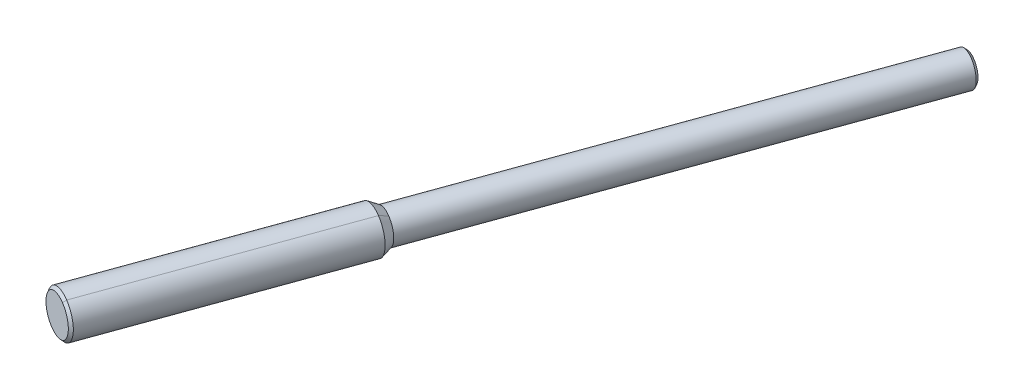
ISO-10303-21;
HEADER;
FILE_DESCRIPTION(('STEP AP214'),'2;1');
FILE_NAME('part.step','',(''),(''),'','','');
FILE_SCHEMA(('AUTOMOTIVE_DESIGN { 1 0 10303 214 1 1 1 1 }'));
ENDSEC;
DATA;
#1=APPLICATION_CONTEXT('core data for automotive mechanical design processes');
#2=APPLICATION_PROTOCOL_DEFINITION('international standard','automotive_design',2000,#1);
#3=PRODUCT_CONTEXT('',#1,'mechanical');
#4=PRODUCT('Part','Part','',(#3));
#5=PRODUCT_RELATED_PRODUCT_CATEGORY('part','',(#4));
#6=PRODUCT_DEFINITION_FORMATION('','',#4);
#7=PRODUCT_DEFINITION_CONTEXT('part definition',#1,'design');
#8=PRODUCT_DEFINITION('design','',#6,#7);
#9=PRODUCT_DEFINITION_SHAPE('','',#8);
#10=(LENGTH_UNIT() NAMED_UNIT(*) SI_UNIT(.MILLI.,.METRE.));
#11=(NAMED_UNIT(*) PLANE_ANGLE_UNIT() SI_UNIT($,.RADIAN.));
#12=(NAMED_UNIT(*) SI_UNIT($,.STERADIAN.) SOLID_ANGLE_UNIT());
#13=UNCERTAINTY_MEASURE_WITH_UNIT(LENGTH_MEASURE(1.E-05),#10,'distance_accuracy_value','');
#14=(GEOMETRIC_REPRESENTATION_CONTEXT(3) GLOBAL_UNCERTAINTY_ASSIGNED_CONTEXT((#13)) GLOBAL_UNIT_ASSIGNED_CONTEXT((#10,
#11,#12)) REPRESENTATION_CONTEXT('',''));
#15=CARTESIAN_POINT('',(0.,0.,0.));
#16=DIRECTION('',(0.,0.,1.));
#17=DIRECTION('',(1.,0.,0.));
#18=AXIS2_PLACEMENT_3D('',#15,#16,#17);
#19=CARTESIAN_POINT('',(187.830924116054,84.359099008181,-199.736990596462));
#20=DIRECTION('',(0.340654989152249,0.000648546411340489,-0.940188150187628));
#21=DIRECTION('',(0.940188366977143,-0.000113870693776996,0.340654989152249));
#22=AXIS2_PLACEMENT_3D('',#19,#20,#21);
#23=CYLINDRICAL_SURFACE('',#22,4.);
#24=CARTESIAN_POINT('',(182.982705002577,84.3498688627037,-186.356185074288));
#25=DIRECTION('',(0.340654989152249,0.000648546411340489,-0.940188150187628));
#26=DIRECTION('',(-0.940188366977143,0.000113870693776996,-0.340654989152249));
#27=AXIS2_PLACEMENT_3D('',#24,#25,#26);
#28=CIRCLE('',#27,4.);
#29=CARTESIAN_POINT('',(184.785306535749,87.8599799791861,-185.700633655592));
#30=VERTEX_POINT('',#29);
#31=CARTESIAN_POINT('',(181.180103469405,80.8397577462213,-187.011736492984));
#32=VERTEX_POINT('',#31);
#33=EDGE_CURVE('E82',#30,#32,#28,.T.);
#34=ORIENTED_EDGE('',*,*,#33,.F.);
#35=DIRECTION('',(0.340654989152249,0.000648546411340489,-0.940188150187628));
#36=VECTOR('',#35,1.);
#37=CARTESIAN_POINT('',(176.989766417852,87.8451386595844,-164.185391910862));
#38=LINE('',#37,#36);
#39=CARTESIAN_POINT('',(169.194226300092,87.830297339983,-142.670150166508));
#40=VERTEX_POINT('',#39);
#41=EDGE_CURVE('E89',#40,#30,#38,.T.);
#42=ORIENTED_EDGE('',*,*,#41,.F.);
#43=CARTESIAN_POINT('',(167.391624766919,84.3201862235005,-143.325701585204));
#44=DIRECTION('',(0.340654989152249,0.000648546411340489,-0.940188150187628));
#45=DIRECTION('',(-0.940188366977143,0.000113870693776996,-0.340654989152249));
#46=AXIS2_PLACEMENT_3D('',#43,#44,#45);
#47=CIRCLE('',#46,4.);
#48=CARTESIAN_POINT('',(165.589023233748,80.8100751070181,-143.9812530039));
#49=VERTEX_POINT('',#48);
#50=EDGE_CURVE('E11',#40,#49,#47,.T.);
#51=ORIENTED_EDGE('',*,*,#50,.T.);
#52=DIRECTION('',(0.340654989152249,0.000648546411340489,-0.940188150187628));
#53=VECTOR('',#52,1.);
#54=CARTESIAN_POINT('',(173.384563351508,80.8249164266196,-165.496494748254));
#55=LINE('',#54,#53);
#56=EDGE_CURVE('E27',#49,#32,#55,.T.);
#57=ORIENTED_EDGE('',*,*,#56,.T.);
#58=EDGE_LOOP('',(#34,#42,#51,#57));
#59=FACE_BOUND('',#58,.T.);
#60=ADVANCED_FACE('F17',(#59),#23,.T.);
#61=CARTESIAN_POINT('',(187.830924116054,84.359099008181,-199.736990596462));
#62=DIRECTION('',(0.340654989152249,0.000648546411340489,-0.940188150187628));
#63=DIRECTION('',(0.940188366977143,-0.000113870693776996,0.340654989152249));
#64=AXIS2_PLACEMENT_3D('',#61,#62,#63);
#65=CYLINDRICAL_SURFACE('',#64,4.);
#66=CARTESIAN_POINT('',(182.982705002577,84.3498688627037,-186.356185074288));
#67=DIRECTION('',(0.340654989152249,0.000648546411340489,-0.940188150187628));
#68=DIRECTION('',(-0.940188366977143,0.000113870693776996,-0.340654989152249));
#69=AXIS2_PLACEMENT_3D('',#66,#67,#68);
#70=CIRCLE('',#69,4.);
#71=EDGE_CURVE('E36',#32,#30,#70,.T.);
#72=ORIENTED_EDGE('',*,*,#71,.F.);
#73=ORIENTED_EDGE('',*,*,#56,.F.);
#74=CARTESIAN_POINT('',(167.391624766919,84.3201862235005,-143.325701585204));
#75=DIRECTION('',(0.340654989152249,0.000648546411340489,-0.940188150187628));
#76=DIRECTION('',(-0.940188366977143,0.000113870693776996,-0.340654989152249));
#77=AXIS2_PLACEMENT_3D('',#74,#75,#76);
#78=CIRCLE('',#77,4.);
#79=EDGE_CURVE('E91',#49,#40,#78,.T.);
#80=ORIENTED_EDGE('',*,*,#79,.T.);
#81=ORIENTED_EDGE('',*,*,#41,.T.);
#82=EDGE_LOOP('',(#72,#73,#80,#81));
#83=FACE_BOUND('',#82,.T.);
#84=ADVANCED_FACE('F131',(#83),#65,.T.);
#85=CARTESIAN_POINT('',(167.221297272343,84.3198619502949,-142.85560751011));
#86=DIRECTION('',(0.340654989152249,0.000648546411340489,-0.940188150187628));
#87=DIRECTION('',(0.450650383292255,0.877527779120979,0.163887854673695));
#88=AXIS2_PLACEMENT_3D('',#85,#86,#87);
#89=CONICAL_SURFACE('',#88,3.5,0.785398163396999);
#90=ORIENTED_EDGE('',*,*,#50,.F.);
#91=DIRECTION('',(0.559537394844707,0.620964434861356,-0.54892720319521));
#92=VECTOR('',#91,1.);
#93=CARTESIAN_POINT('',(168.996399956981,87.6107532586025,-142.476075092629));
#94=LINE('',#93,#92);
#95=CARTESIAN_POINT('',(168.798573613861,87.391209177222,-142.282000018754));
#96=VERTEX_POINT('',#95);
#97=EDGE_CURVE('E97',#96,#40,#94,.T.);
#98=ORIENTED_EDGE('',*,*,#97,.F.);
#99=CARTESIAN_POINT('',(167.221297272343,84.3198619502949,-142.85560751011));
#100=DIRECTION('',(0.340654989152249,0.000648546411340489,-0.940188150187628));
#101=DIRECTION('',(-0.940188366977143,0.000113870693778979,-0.340654989152249));
#102=AXIS2_PLACEMENT_3D('',#99,#100,#101);
#103=CIRCLE('',#102,3.5);
#104=CARTESIAN_POINT('',(165.644020930825,81.2485147233678,-143.429215001467));
#105=VERTEX_POINT('',#104);
#106=EDGE_CURVE('E92',#96,#105,#103,.T.);
#107=ORIENTED_EDGE('',*,*,#106,.T.);
#108=DIRECTION('',(-0.0777784890954522,-0.62004725173061,-0.780699629982842));
#109=VECTOR('',#108,1.);
#110=CARTESIAN_POINT('',(165.616522082281,81.0292949151929,-143.705234002685));
#111=LINE('',#110,#109);
#112=EDGE_CURVE('E104',#105,#49,#111,.T.);
#113=ORIENTED_EDGE('',*,*,#112,.T.);
#114=EDGE_LOOP('',(#90,#98,#107,#113));
#115=FACE_BOUND('',#114,.T.);
#116=ADVANCED_FACE('F137',(#115),#89,.T.);
#117=CARTESIAN_POINT('',(167.221297272343,84.3198619502949,-142.85560751011));
#118=DIRECTION('',(0.340654989152249,0.000648546411340489,-0.940188150187628));
#119=DIRECTION('',(0.450650383292255,0.877527779120979,0.163887854673695));
#120=AXIS2_PLACEMENT_3D('',#117,#118,#119);
#121=CONICAL_SURFACE('',#120,3.5,0.785398163396999);
#122=ORIENTED_EDGE('',*,*,#79,.F.);
#123=ORIENTED_EDGE('',*,*,#112,.F.);
#124=CARTESIAN_POINT('',(167.221297272343,84.3198619502949,-142.85560751011));
#125=DIRECTION('',(0.340654989152249,0.000648546411340489,-0.940188150187628));
#126=DIRECTION('',(-0.940188366977143,0.000113870693778979,-0.340654989152249));
#127=AXIS2_PLACEMENT_3D('',#124,#125,#126);
#128=CIRCLE('',#127,3.5);
#129=EDGE_CURVE('E100',#105,#96,#128,.T.);
#130=ORIENTED_EDGE('',*,*,#129,.T.);
#131=ORIENTED_EDGE('',*,*,#97,.T.);
#132=EDGE_LOOP('',(#122,#123,#130,#131));
#133=FACE_BOUND('',#132,.T.);
#134=ADVANCED_FACE('F127',(#133),#121,.T.);
#135=CARTESIAN_POINT('',(187.830924116054,84.359099008181,-199.736990596462));
#136=DIRECTION('',(0.340654989152249,0.000648546411340489,-0.940188150187628));
#137=DIRECTION('',(0.940188366977143,-0.000113870693776997,0.340654989152249));
#138=AXIS2_PLACEMENT_3D('',#135,#136,#137);
#139=CYLINDRICAL_SURFACE('',#138,3.);
#140=CARTESIAN_POINT('',(212.698738324168,84.4064428962088,-268.370725560159));
#141=DIRECTION('',(-0.340654989152249,-0.000648546411340489,0.940188150187628));
#142=DIRECTION('',(-0.940188366977143,0.000113870693776991,-0.340654989152249));
#143=AXIS2_PLACEMENT_3D('',#140,#141,#142);
#144=CIRCLE('',#143,3.);
#145=CARTESIAN_POINT('',(209.878173223237,84.4067845082901,-269.392690527616));
#146=VERTEX_POINT('',#145);
#147=EDGE_CURVE('E101',#146,#146,#144,.T.);
#148=ORIENTED_EDGE('',*,*,#147,.T.);
#149=EDGE_LOOP('',(#148));
#150=FACE_BOUND('',#149,.T.);
#151=DIRECTION('',(-0.340654989152249,-0.000648546411340489,0.940188150187628));
#152=VECTOR('',#151,1.);
#153=CARTESIAN_POINT('',(197.273431258294,87.0070853228121,-221.574795599398));
#154=LINE('',#153,#152);
#155=CARTESIAN_POINT('',(209.111192131335,87.0296223106062,-254.246333818418));
#156=VERTEX_POINT('',#155);
#157=CARTESIAN_POINT('',(184.924687901525,86.9835755154011,-187.492975155097));
#158=VERTEX_POINT('',#157);
#159=EDGE_CURVE('E111',#156,#158,#154,.T.);
#160=ORIENTED_EDGE('',*,*,#159,.F.);
#161=ORIENTED_EDGE('',*,*,#159,.T.);
#162=CARTESIAN_POINT('',(183.572736751651,84.3509921780392,-187.984638719117));
#163=DIRECTION('',(0.340654989152249,0.000648546411340489,-0.940188150187628));
#164=DIRECTION('',(-0.940188366977143,0.000113870693776997,-0.340654989152249));
#165=AXIS2_PLACEMENT_3D('',#162,#163,#164);
#166=CIRCLE('',#165,3.);
#167=CARTESIAN_POINT('',(182.220785601777,81.7184088406774,-188.476302283137));
#168=VERTEX_POINT('',#167);
#169=EDGE_CURVE('E114',#158,#168,#166,.T.);
#170=ORIENTED_EDGE('',*,*,#169,.T.);
#171=DIRECTION('',(-0.340654989152249,-0.000648546411340489,0.940188150187628));
#172=VECTOR('',#171,1.);
#173=CARTESIAN_POINT('',(194.569528958546,81.7419186480885,-222.558122727438));
#174=LINE('',#173,#172);
#175=CARTESIAN_POINT('',(206.407289831587,81.7644556358826,-255.229660946459));
#176=VERTEX_POINT('',#175);
#177=EDGE_CURVE('E68',#176,#168,#174,.T.);
#178=ORIENTED_EDGE('',*,*,#177,.F.);
#179=ORIENTED_EDGE('',*,*,#177,.T.);
#180=CARTESIAN_POINT('',(183.572736751651,84.3509921780392,-187.984638719117));
#181=DIRECTION('',(0.340654989152249,0.000648546411340489,-0.940188150187628));
#182=DIRECTION('',(-0.940188366977143,0.000113870693776997,-0.340654989152249));
#183=AXIS2_PLACEMENT_3D('',#180,#181,#182);
#184=CIRCLE('',#183,3.);
#185=EDGE_CURVE('E79',#168,#158,#184,.T.);
#186=ORIENTED_EDGE('',*,*,#185,.T.);
#187=EDGE_LOOP('',(#160,#161,#170,#178,#179,#186));
#188=FACE_BOUND('',#187,.T.);
#189=ADVANCED_FACE('F115',(#150,#188),#139,.T.);
#190=CARTESIAN_POINT('',(183.572736751651,84.3509921780392,-187.984638719117));
#191=DIRECTION('',(-0.340654989152249,-0.000648546411340489,0.940188150187628));
#192=DIRECTION('',(0.450650383292255,0.877527779120979,0.163887854673695));
#193=AXIS2_PLACEMENT_3D('',#190,#191,#192);
#194=CONICAL_SURFACE('',#193,3.,0.523598775598001);
#195=ORIENTED_EDGE('',*,*,#169,.F.);
#196=DIRECTION('',(0.0696906828856126,-0.438202231892763,-0.896170749736421));
#197=VECTOR('',#196,1.);
#198=CARTESIAN_POINT('',(184.854997218633,87.4217777472986,-186.596804405346));
#199=LINE('',#198,#197);
#200=EDGE_CURVE('E73',#30,#158,#199,.T.);
#201=ORIENTED_EDGE('',*,*,#200,.F.);
#202=ORIENTED_EDGE('',*,*,#33,.T.);
#203=DIRECTION('',(0.520341066177894,0.439325547228271,-0.732282895062716));
#204=VECTOR('',#203,1.);
#205=CARTESIAN_POINT('',(181.700444535595,81.2790832934443,-187.744019388059));
#206=LINE('',#205,#204);
#207=EDGE_CURVE('E76',#32,#168,#206,.T.);
#208=ORIENTED_EDGE('',*,*,#207,.T.);
#209=EDGE_LOOP('',(#195,#201,#202,#208));
#210=FACE_BOUND('',#209,.T.);
#211=ADVANCED_FACE('F116',(#210),#194,.T.);
#212=CARTESIAN_POINT('',(183.572736751651,84.3509921780392,-187.984638719117));
#213=DIRECTION('',(-0.340654989152249,-0.000648546411340489,0.940188150187628));
#214=DIRECTION('',(0.450650383292255,0.877527779120979,0.163887854673695));
#215=AXIS2_PLACEMENT_3D('',#212,#213,#214);
#216=CONICAL_SURFACE('',#215,3.,0.523598775598001);
#217=ORIENTED_EDGE('',*,*,#185,.F.);
#218=ORIENTED_EDGE('',*,*,#207,.F.);
#219=ORIENTED_EDGE('',*,*,#71,.T.);
#220=ORIENTED_EDGE('',*,*,#200,.T.);
#221=EDGE_LOOP('',(#217,#218,#219,#220));
#222=FACE_BOUND('',#221,.T.);
#223=ADVANCED_FACE('F118',(#222),#216,.T.);
#224=CARTESIAN_POINT('',(167.221297272343,84.3198619502949,-142.85560751011));
#225=DIRECTION('',(0.340654989152249,0.000648546411340489,-0.940188150187628));
#226=DIRECTION('',(0.940188366977143,-0.000113870693777093,0.340654989152249));
#227=AXIS2_PLACEMENT_3D('',#224,#225,#226);
#228=PLANE('',#227);
#229=ORIENTED_EDGE('',*,*,#106,.F.);
#230=ORIENTED_EDGE('',*,*,#129,.F.);
#231=EDGE_LOOP('',(#229,#230));
#232=FACE_BOUND('',#231,.T.);
#233=ADVANCED_FACE('F125',(#232),#228,.F.);
#234=CARTESIAN_POINT('',(212.869065818745,84.4067671694145,-268.840819635253));
#235=DIRECTION('',(0.340654989152249,0.000648546411340489,-0.940188150187628));
#236=DIRECTION('',(0.940188366977143,-0.000113870693777093,0.340654989152249));
#237=AXIS2_PLACEMENT_3D('',#234,#235,#236);
#238=PLANE('',#237);
#239=CARTESIAN_POINT('',(212.869065818745,84.4067671694145,-268.840819635253));
#240=DIRECTION('',(0.340654989152249,0.000648546411340489,-0.940188150187628));
#241=DIRECTION('',(-0.940188366977143,0.000113870693779768,-0.340654989152249));
#242=AXIS2_PLACEMENT_3D('',#239,#240,#241);
#243=CIRCLE('',#242,2.5);
#244=CARTESIAN_POINT('',(210.518594901302,84.407051846149,-269.692457108133));
#245=VERTEX_POINT('',#244);
#246=EDGE_CURVE('E21',#245,#245,#243,.T.);
#247=ORIENTED_EDGE('',*,*,#246,.T.);
#248=EDGE_LOOP('',(#247));
#249=FACE_BOUND('',#248,.T.);
#250=ADVANCED_FACE('F154',(#249),#238,.T.);
#251=CARTESIAN_POINT('',(212.869065818745,84.4067671694145,-268.840819635253));
#252=DIRECTION('',(-0.340654989152249,-0.000648546411340489,0.940188150187628));
#253=DIRECTION('',(-0.940188366977143,0.0001138706937771,-0.340654989152249));
#254=AXIS2_PLACEMENT_3D('',#251,#252,#253);
#255=CONICAL_SURFACE('',#254,2.5,0.785398163397448);
#256=ORIENTED_EDGE('',*,*,#147,.F.);
#257=EDGE_LOOP('',(#256));
#258=FACE_BOUND('',#257,.T.);
#259=ORIENTED_EDGE('',*,*,#246,.F.);
#260=EDGE_LOOP('',(#259));
#261=FACE_BOUND('',#260,.T.);
#262=ADVANCED_FACE('F19',(#258,#261),#255,.T.);
#263=CLOSED_SHELL('',(#60,#84,#116,#134,#189,#211,#223,#233,#250,#262));
#264=MANIFOLD_SOLID_BREP('B1',#263);
#265=ADVANCED_BREP_SHAPE_REPRESENTATION('',(#18,#264),#14);
#266=SHAPE_DEFINITION_REPRESENTATION(#9,#265);
ENDSEC;
END-ISO-10303-21;
